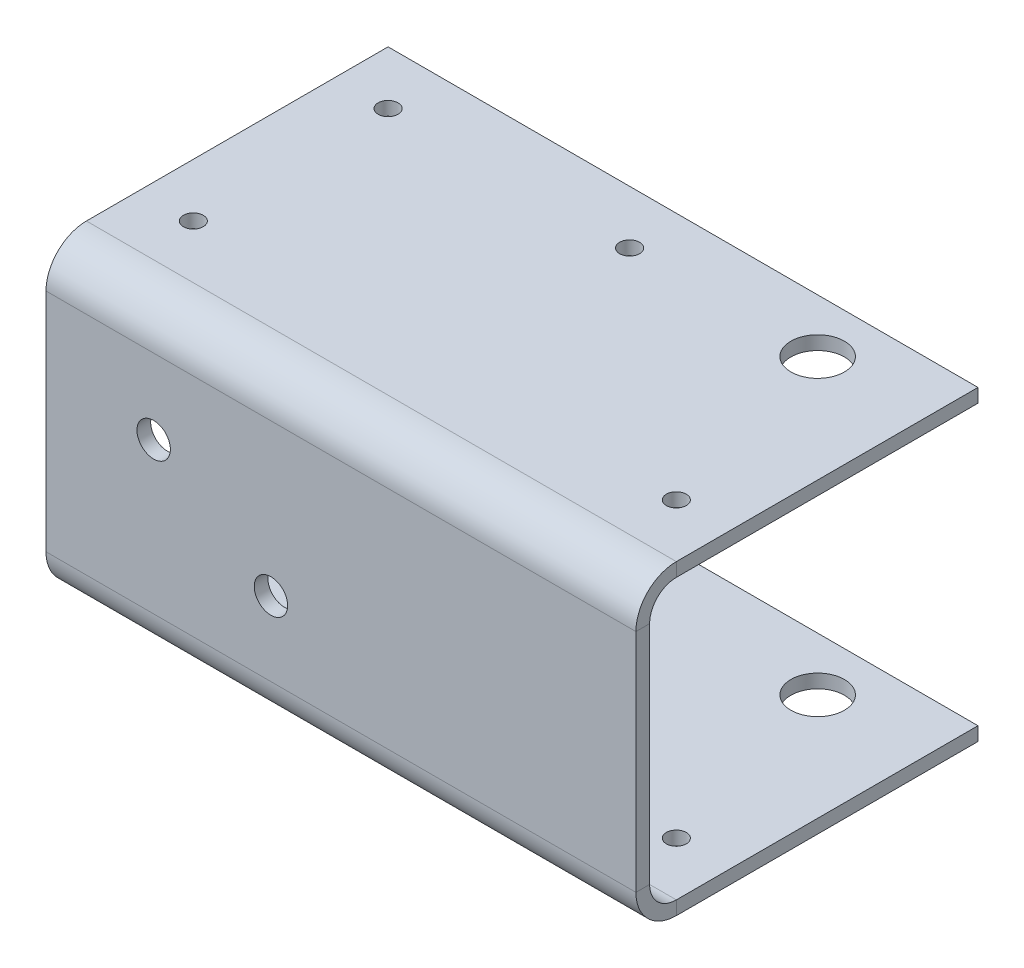
ISO-10303-21;
HEADER;
FILE_DESCRIPTION(('STEP AP214'),'2;1');
FILE_NAME('part.step','',(''),(''),'','','');
FILE_SCHEMA(('AUTOMOTIVE_DESIGN { 1 0 10303 214 1 1 1 1 }'));
ENDSEC;
DATA;
#1=APPLICATION_CONTEXT('core data for automotive mechanical design processes');
#2=APPLICATION_PROTOCOL_DEFINITION('international standard','automotive_design',2000,#1);
#3=PRODUCT_CONTEXT('',#1,'mechanical');
#4=PRODUCT('Part','Part','',(#3));
#5=PRODUCT_RELATED_PRODUCT_CATEGORY('part','',(#4));
#6=PRODUCT_DEFINITION_FORMATION('','',#4);
#7=PRODUCT_DEFINITION_CONTEXT('part definition',#1,'design');
#8=PRODUCT_DEFINITION('design','',#6,#7);
#9=PRODUCT_DEFINITION_SHAPE('','',#8);
#10=(LENGTH_UNIT() NAMED_UNIT(*) SI_UNIT(.MILLI.,.METRE.));
#11=(NAMED_UNIT(*) PLANE_ANGLE_UNIT() SI_UNIT($,.RADIAN.));
#12=(NAMED_UNIT(*) SI_UNIT($,.STERADIAN.) SOLID_ANGLE_UNIT());
#13=UNCERTAINTY_MEASURE_WITH_UNIT(LENGTH_MEASURE(1.E-05),#10,'distance_accuracy_value','');
#14=(GEOMETRIC_REPRESENTATION_CONTEXT(3) GLOBAL_UNCERTAINTY_ASSIGNED_CONTEXT((#13)) GLOBAL_UNIT_ASSIGNED_CONTEXT((#10,
#11,#12)) REPRESENTATION_CONTEXT('',''));
#15=CARTESIAN_POINT('',(0.,0.,0.));
#16=DIRECTION('',(0.,0.,1.));
#17=DIRECTION('',(1.,0.,0.));
#18=AXIS2_PLACEMENT_3D('',#15,#16,#17);
#19=CARTESIAN_POINT('',(-23.0449634343967,-12.8171515576315,0.8128));
#20=DIRECTION('',(1.,0.,0.));
#21=DIRECTION('',(0.,1.,0.));
#22=AXIS2_PLACEMENT_3D('',#19,#20,#21);
#23=PLANE('',#22);
#24=DIRECTION('',(0.,0.,1.));
#25=VECTOR('',#24,1.);
#26=CARTESIAN_POINT('',(-23.0449634343967,-11.2296515576315,0.));
#27=LINE('',#26,#25);
#28=CARTESIAN_POINT('',(-23.0449634343967,-11.2296515576315,0.));
#29=VERTEX_POINT('',#28);
#30=CARTESIAN_POINT('',(-23.0449634343967,-11.2296515576315,0.812800000000019));
#31=VERTEX_POINT('',#30);
#32=EDGE_CURVE('E181',#29,#31,#27,.T.);
#33=ORIENTED_EDGE('',*,*,#32,.T.);
#34=DIRECTION('',(0.,-1.,0.));
#35=VECTOR('',#34,1.);
#36=CARTESIAN_POINT('',(-23.0449634343967,-12.8171515576315,0.8128));
#37=LINE('',#36,#35);
#38=CARTESIAN_POINT('',(-23.0449634343967,2.18534844236849,0.8128));
#39=VERTEX_POINT('',#38);
#40=EDGE_CURVE('E44',#39,#31,#37,.T.);
#41=ORIENTED_EDGE('',*,*,#40,.F.);
#42=DIRECTION('',(0.,0.,1.));
#43=VECTOR('',#42,1.);
#44=CARTESIAN_POINT('',(-23.0449634343967,2.18534844236849,0.));
#45=LINE('',#44,#43);
#46=CARTESIAN_POINT('',(-23.0449634343967,2.18534844236849,0.));
#47=VERTEX_POINT('',#46);
#48=EDGE_CURVE('E240',#47,#39,#45,.T.);
#49=ORIENTED_EDGE('',*,*,#48,.F.);
#50=DIRECTION('',(0.,-1.,0.));
#51=VECTOR('',#50,1.);
#52=CARTESIAN_POINT('',(-23.0449634343967,-12.8171515576315,0.));
#53=LINE('',#52,#51);
#54=EDGE_CURVE('E243',#47,#29,#53,.T.);
#55=ORIENTED_EDGE('',*,*,#54,.T.);
#56=EDGE_LOOP('',(#33,#41,#49,#55));
#57=FACE_BOUND('',#56,.T.);
#58=ADVANCED_FACE('F36',(#57),#23,.F.);
#59=CARTESIAN_POINT('',(11.9971823881,3.77284844236843,0.8128));
#60=DIRECTION('',(-1.,0.,0.));
#61=DIRECTION('',(0.,0.,1.));
#62=AXIS2_PLACEMENT_3D('',#59,#60,#61);
#63=PLANE('',#62);
#64=DIRECTION('',(0.,0.,1.));
#65=VECTOR('',#64,1.);
#66=CARTESIAN_POINT('',(11.9971823881,-11.2296515576315,0.));
#67=LINE('',#66,#65);
#68=CARTESIAN_POINT('',(11.9971823881,-11.2296515576315,0.));
#69=VERTEX_POINT('',#68);
#70=CARTESIAN_POINT('',(11.9971823881,-11.2296515576315,0.8128));
#71=VERTEX_POINT('',#70);
#72=EDGE_CURVE('E187',#69,#71,#67,.T.);
#73=ORIENTED_EDGE('',*,*,#72,.F.);
#74=DIRECTION('',(0.,1.,0.));
#75=VECTOR('',#74,1.);
#76=CARTESIAN_POINT('',(11.9971823881,3.77284844236843,0.));
#77=LINE('',#76,#75);
#78=CARTESIAN_POINT('',(11.9971823881,2.18534844236846,0.));
#79=VERTEX_POINT('',#78);
#80=EDGE_CURVE('E59',#69,#79,#77,.T.);
#81=ORIENTED_EDGE('',*,*,#80,.T.);
#82=DIRECTION('',(0.,0.,1.));
#83=VECTOR('',#82,1.);
#84=CARTESIAN_POINT('',(11.9971823881,2.18534844236843,0.));
#85=LINE('',#84,#83);
#86=CARTESIAN_POINT('',(11.9971823881,2.18534844236843,0.812799999999992));
#87=VERTEX_POINT('',#86);
#88=EDGE_CURVE('E229',#79,#87,#85,.T.);
#89=ORIENTED_EDGE('',*,*,#88,.T.);
#90=DIRECTION('',(0.,1.,0.));
#91=VECTOR('',#90,1.);
#92=CARTESIAN_POINT('',(11.9971823881,3.77284844236843,0.8128));
#93=LINE('',#92,#91);
#94=EDGE_CURVE('E11',#71,#87,#93,.T.);
#95=ORIENTED_EDGE('',*,*,#94,.F.);
#96=EDGE_LOOP('',(#73,#81,#89,#95));
#97=FACE_BOUND('',#96,.T.);
#98=ADVANCED_FACE('F333',(#97),#63,.F.);
#99=CARTESIAN_POINT('',(0.,0.,0.8128));
#100=DIRECTION('',(0.,0.,-1.));
#101=DIRECTION('',(-1.,0.,0.));
#102=AXIS2_PLACEMENT_3D('',#99,#100,#101);
#103=PLANE('',#102);
#104=CARTESIAN_POINT('',(-16.6488971624936,-2.26965155763172,0.8128));
#105=DIRECTION('',(0.,0.,1.));
#106=DIRECTION('',(1.,0.,0.));
#107=AXIS2_PLACEMENT_3D('',#104,#105,#106);
#108=CIRCLE('',#107,0.992251);
#109=CARTESIAN_POINT('',(-15.6566461624936,-2.26965155763172,0.8128));
#110=VERTEX_POINT('',#109);
#111=EDGE_CURVE('E490',#110,#110,#108,.T.);
#112=ORIENTED_EDGE('',*,*,#111,.F.);
#113=EDGE_LOOP('',(#112));
#114=FACE_BOUND('',#113,.T.);
#115=CARTESIAN_POINT('',(-9.68389716249362,-6.82465155763173,0.8128));
#116=DIRECTION('',(0.,0.,1.));
#117=DIRECTION('',(1.,0.,0.));
#118=AXIS2_PLACEMENT_3D('',#115,#116,#117);
#119=CIRCLE('',#118,0.992251);
#120=CARTESIAN_POINT('',(-8.69164616249362,-6.82465155763173,0.8128));
#121=VERTEX_POINT('',#120);
#122=EDGE_CURVE('E406',#121,#121,#119,.T.);
#123=ORIENTED_EDGE('',*,*,#122,.F.);
#124=EDGE_LOOP('',(#123));
#125=FACE_BOUND('',#124,.T.);
#126=DIRECTION('',(-1.,0.,0.));
#127=VECTOR('',#126,1.);
#128=CARTESIAN_POINT('',(-23.0449634343967,-11.2296515576315,0.812800000000019));
#129=LINE('',#128,#127);
#130=EDGE_CURVE('E134',#31,#71,#129,.F.);
#131=ORIENTED_EDGE('',*,*,#130,.T.);
#132=ORIENTED_EDGE('',*,*,#94,.T.);
#133=DIRECTION('',(1.,0.,0.));
#134=VECTOR('',#133,1.);
#135=CARTESIAN_POINT('',(11.9971823881,2.18534844236843,0.812799999999992));
#136=LINE('',#135,#134);
#137=EDGE_CURVE('E223',#87,#39,#136,.F.);
#138=ORIENTED_EDGE('',*,*,#137,.T.);
#139=ORIENTED_EDGE('',*,*,#40,.T.);
#140=EDGE_LOOP('',(#131,#132,#138,#139));
#141=FACE_BOUND('',#140,.T.);
#142=ADVANCED_FACE('F338',(#114,#125,#141),#103,.F.);
#143=CARTESIAN_POINT('',(0.,0.,0.));
#144=DIRECTION('',(0.,0.,-1.));
#145=DIRECTION('',(-1.,0.,0.));
#146=AXIS2_PLACEMENT_3D('',#143,#144,#145);
#147=PLANE('',#146);
#148=CARTESIAN_POINT('',(-16.6488971624936,-2.26965155763172,0.));
#149=DIRECTION('',(0.,0.,-1.));
#150=DIRECTION('',(-1.,0.,0.));
#151=AXIS2_PLACEMENT_3D('',#148,#149,#150);
#152=CIRCLE('',#151,0.992250999999998);
#153=CARTESIAN_POINT('',(-17.6411481624936,-2.26965155763172,0.));
#154=VERTEX_POINT('',#153);
#155=EDGE_CURVE('E400',#154,#154,#152,.T.);
#156=ORIENTED_EDGE('',*,*,#155,.F.);
#157=EDGE_LOOP('',(#156));
#158=FACE_BOUND('',#157,.T.);
#159=CARTESIAN_POINT('',(-9.68389716249362,-6.82465155763173,0.));
#160=DIRECTION('',(0.,0.,-1.));
#161=DIRECTION('',(-1.,0.,0.));
#162=AXIS2_PLACEMENT_3D('',#159,#160,#161);
#163=CIRCLE('',#162,0.992250999999998);
#164=CARTESIAN_POINT('',(-10.6761481624936,-6.82465155763173,0.));
#165=VERTEX_POINT('',#164);
#166=EDGE_CURVE('E403',#165,#165,#163,.T.);
#167=ORIENTED_EDGE('',*,*,#166,.F.);
#168=EDGE_LOOP('',(#167));
#169=FACE_BOUND('',#168,.T.);
#170=ORIENTED_EDGE('',*,*,#80,.F.);
#171=DIRECTION('',(-1.,0.,0.));
#172=VECTOR('',#171,1.);
#173=CARTESIAN_POINT('',(-23.0449634343967,-11.2296515576315,0.));
#174=LINE('',#173,#172);
#175=EDGE_CURVE('E52',#29,#69,#174,.F.);
#176=ORIENTED_EDGE('',*,*,#175,.F.);
#177=ORIENTED_EDGE('',*,*,#54,.F.);
#178=DIRECTION('',(1.,0.,0.));
#179=VECTOR('',#178,1.);
#180=CARTESIAN_POINT('',(11.9971823881,2.18534844236843,0.));
#181=LINE('',#180,#179);
#182=EDGE_CURVE('E235',#79,#47,#181,.F.);
#183=ORIENTED_EDGE('',*,*,#182,.F.);
#184=EDGE_LOOP('',(#170,#176,#177,#183));
#185=FACE_BOUND('',#184,.T.);
#186=ADVANCED_FACE('F340',(#158,#169,#185),#147,.T.);
#187=CARTESIAN_POINT('',(-23.0449634343967,2.18534844236849,-1.5875));
#188=DIRECTION('',(-1.,0.,0.));
#189=DIRECTION('',(0.,-1.,0.));
#190=AXIS2_PLACEMENT_3D('',#187,#188,#189);
#191=PLANE('',#190);
#192=DIRECTION('',(0.,1.,0.));
#193=VECTOR('',#192,1.);
#194=CARTESIAN_POINT('',(-23.0449634343967,3.77284844236848,-1.58749999999999));
#195=LINE('',#194,#193);
#196=CARTESIAN_POINT('',(-23.0449634343967,3.77284844236848,-1.58749999999999));
#197=VERTEX_POINT('',#196);
#198=CARTESIAN_POINT('',(-23.0449634343967,4.58564844236848,-1.58749999999999));
#199=VERTEX_POINT('',#198);
#200=EDGE_CURVE('E190',#197,#199,#195,.T.);
#201=ORIENTED_EDGE('',*,*,#200,.F.);
#202=CARTESIAN_POINT('',(-23.0449634343967,2.18534844236849,-1.5875));
#203=DIRECTION('',(1.,0.,0.));
#204=DIRECTION('',(0.,1.,0.));
#205=AXIS2_PLACEMENT_3D('',#202,#203,#204);
#206=CIRCLE('',#205,1.58749999999999);
#207=EDGE_CURVE('E232',#47,#197,#206,.F.);
#208=ORIENTED_EDGE('',*,*,#207,.F.);
#209=ORIENTED_EDGE('',*,*,#48,.T.);
#210=CARTESIAN_POINT('',(-23.0449634343967,2.18534844236849,-1.5875));
#211=DIRECTION('',(1.,0.,0.));
#212=DIRECTION('',(0.,1.,0.));
#213=AXIS2_PLACEMENT_3D('',#210,#211,#212);
#214=CIRCLE('',#213,2.40029999999999);
#215=EDGE_CURVE('E225',#39,#199,#214,.F.);
#216=ORIENTED_EDGE('',*,*,#215,.T.);
#217=EDGE_LOOP('',(#201,#208,#209,#216));
#218=FACE_BOUND('',#217,.T.);
#219=ADVANCED_FACE('F348',(#218),#191,.T.);
#220=CARTESIAN_POINT('',(11.9971823881,2.18534844236843,-1.5875));
#221=DIRECTION('',(-1.,0.,0.));
#222=DIRECTION('',(0.,-1.,0.));
#223=AXIS2_PLACEMENT_3D('',#220,#221,#222);
#224=PLANE('',#223);
#225=CARTESIAN_POINT('',(11.9971823881,2.18534844236843,-1.5875));
#226=DIRECTION('',(1.,0.,0.));
#227=DIRECTION('',(0.,1.,0.));
#228=AXIS2_PLACEMENT_3D('',#225,#226,#227);
#229=CIRCLE('',#228,1.58749999999999);
#230=CARTESIAN_POINT('',(11.9971823881,3.77284844236843,-1.5875));
#231=VERTEX_POINT('',#230);
#232=EDGE_CURVE('E222',#231,#79,#229,.T.);
#233=ORIENTED_EDGE('',*,*,#232,.F.);
#234=DIRECTION('',(0.,1.,0.));
#235=VECTOR('',#234,1.);
#236=CARTESIAN_POINT('',(11.9971823881,3.77284844236844,-1.5875));
#237=LINE('',#236,#235);
#238=CARTESIAN_POINT('',(11.9971823881,4.58564844236846,-1.58749999999999));
#239=VERTEX_POINT('',#238);
#240=EDGE_CURVE('E195',#231,#239,#237,.T.);
#241=ORIENTED_EDGE('',*,*,#240,.T.);
#242=CARTESIAN_POINT('',(11.9971823881,2.18534844236843,-1.5875));
#243=DIRECTION('',(1.,0.,0.));
#244=DIRECTION('',(0.,1.,0.));
#245=AXIS2_PLACEMENT_3D('',#242,#243,#244);
#246=CIRCLE('',#245,2.40029999999999);
#247=EDGE_CURVE('E226',#239,#87,#246,.T.);
#248=ORIENTED_EDGE('',*,*,#247,.T.);
#249=ORIENTED_EDGE('',*,*,#88,.F.);
#250=EDGE_LOOP('',(#233,#241,#248,#249));
#251=FACE_BOUND('',#250,.T.);
#252=ADVANCED_FACE('F369',(#251),#224,.F.);
#253=CARTESIAN_POINT('',(11.9971823881,2.18534844236843,-1.5875));
#254=DIRECTION('',(1.,0.,0.));
#255=DIRECTION('',(0.,1.,0.));
#256=AXIS2_PLACEMENT_3D('',#253,#254,#255);
#257=CYLINDRICAL_SURFACE('',#256,2.40029999999999);
#258=ORIENTED_EDGE('',*,*,#137,.F.);
#259=ORIENTED_EDGE('',*,*,#247,.F.);
#260=DIRECTION('',(-1.,0.,0.));
#261=VECTOR('',#260,1.);
#262=CARTESIAN_POINT('',(0.,4.58564844236845,-1.58749999999999));
#263=LINE('',#262,#261);
#264=EDGE_CURVE('E198',#239,#199,#263,.T.);
#265=ORIENTED_EDGE('',*,*,#264,.T.);
#266=ORIENTED_EDGE('',*,*,#215,.F.);
#267=EDGE_LOOP('',(#258,#259,#265,#266));
#268=FACE_BOUND('',#267,.T.);
#269=ADVANCED_FACE('F379',(#268),#257,.T.);
#270=CARTESIAN_POINT('',(11.9971823881,2.18534844236843,-1.5875));
#271=DIRECTION('',(1.,0.,0.));
#272=DIRECTION('',(0.,1.,0.));
#273=AXIS2_PLACEMENT_3D('',#270,#271,#272);
#274=CYLINDRICAL_SURFACE('',#273,1.58749999999999);
#275=ORIENTED_EDGE('',*,*,#182,.T.);
#276=ORIENTED_EDGE('',*,*,#207,.T.);
#277=DIRECTION('',(1.,0.,0.));
#278=VECTOR('',#277,1.);
#279=CARTESIAN_POINT('',(-23.0449634343967,3.77284844236848,-1.58749999999999));
#280=LINE('',#279,#278);
#281=EDGE_CURVE('E193',#197,#231,#280,.T.);
#282=ORIENTED_EDGE('',*,*,#281,.T.);
#283=ORIENTED_EDGE('',*,*,#232,.T.);
#284=EDGE_LOOP('',(#275,#276,#282,#283));
#285=FACE_BOUND('',#284,.T.);
#286=ADVANCED_FACE('F344',(#285),#274,.F.);
#287=CARTESIAN_POINT('',(11.9971823880999,4.5856484423685,-19.5072));
#288=DIRECTION('',(-1.,0.,0.));
#289=DIRECTION('',(0.,-1.,0.));
#290=AXIS2_PLACEMENT_3D('',#287,#288,#289);
#291=PLANE('',#290);
#292=ORIENTED_EDGE('',*,*,#240,.F.);
#293=DIRECTION('',(0.,0.,-1.));
#294=VECTOR('',#293,1.);
#295=CARTESIAN_POINT('',(11.9971823880999,3.7728484423685,-19.5072));
#296=LINE('',#295,#294);
#297=CARTESIAN_POINT('',(11.9971823880999,3.7728484423685,-19.5072));
#298=VERTEX_POINT('',#297);
#299=EDGE_CURVE('E202',#231,#298,#296,.T.);
#300=ORIENTED_EDGE('',*,*,#299,.T.);
#301=DIRECTION('',(0.,-1.,0.));
#302=VECTOR('',#301,1.);
#303=CARTESIAN_POINT('',(11.9971823880999,4.5856484423685,-19.5072));
#304=LINE('',#303,#302);
#305=CARTESIAN_POINT('',(11.9971823880999,4.5856484423685,-19.5072));
#306=VERTEX_POINT('',#305);
#307=EDGE_CURVE('E219',#306,#298,#304,.T.);
#308=ORIENTED_EDGE('',*,*,#307,.F.);
#309=DIRECTION('',(0.,0.,-1.));
#310=VECTOR('',#309,1.);
#311=CARTESIAN_POINT('',(11.9971823880999,4.5856484423685,-19.5072));
#312=LINE('',#311,#310);
#313=EDGE_CURVE('E203',#239,#306,#312,.T.);
#314=ORIENTED_EDGE('',*,*,#313,.F.);
#315=EDGE_LOOP('',(#292,#300,#308,#314));
#316=FACE_BOUND('',#315,.T.);
#317=ADVANCED_FACE('F371',(#316),#291,.F.);
#318=CARTESIAN_POINT('',(-23.0449634343967,4.58564844236848,0.));
#319=DIRECTION('',(1.,0.,0.));
#320=DIRECTION('',(0.,1.,0.));
#321=AXIS2_PLACEMENT_3D('',#318,#319,#320);
#322=PLANE('',#321);
#323=ORIENTED_EDGE('',*,*,#200,.T.);
#324=DIRECTION('',(0.,0.,1.));
#325=VECTOR('',#324,1.);
#326=CARTESIAN_POINT('',(-23.0449634343967,4.58564844236848,0.));
#327=LINE('',#326,#325);
#328=CARTESIAN_POINT('',(-23.0449634343967,4.58564844236855,-19.5072));
#329=VERTEX_POINT('',#328);
#330=EDGE_CURVE('E208',#329,#199,#327,.T.);
#331=ORIENTED_EDGE('',*,*,#330,.F.);
#332=DIRECTION('',(0.,-1.,0.));
#333=VECTOR('',#332,1.);
#334=CARTESIAN_POINT('',(-23.0449634343967,4.58564844236855,-19.5072));
#335=LINE('',#334,#333);
#336=CARTESIAN_POINT('',(-23.0449634343967,3.77284844236855,-19.5072));
#337=VERTEX_POINT('',#336);
#338=EDGE_CURVE('E211',#329,#337,#335,.T.);
#339=ORIENTED_EDGE('',*,*,#338,.T.);
#340=DIRECTION('',(0.,0.,1.));
#341=VECTOR('',#340,1.);
#342=CARTESIAN_POINT('',(-23.0449634343967,3.77284844236848,0.));
#343=LINE('',#342,#341);
#344=EDGE_CURVE('E206',#337,#197,#343,.T.);
#345=ORIENTED_EDGE('',*,*,#344,.T.);
#346=EDGE_LOOP('',(#323,#331,#339,#345));
#347=FACE_BOUND('',#346,.T.);
#348=ADVANCED_FACE('F352',(#347),#322,.F.);
#349=CARTESIAN_POINT('',(0.,4.58564844236845,0.));
#350=DIRECTION('',(0.,-1.,0.));
#351=DIRECTION('',(0.,0.,-1.));
#352=AXIS2_PLACEMENT_3D('',#349,#350,#351);
#353=PLANE('',#352);
#354=CARTESIAN_POINT('',(-5.52389052314841,4.58564844236854,-16.3322));
#355=DIRECTION('',(0.,-1.,0.));
#356=DIRECTION('',(0.,0.,-1.));
#357=AXIS2_PLACEMENT_3D('',#354,#355,#356);
#358=CIRCLE('',#357,0.590549999999997);
#359=CARTESIAN_POINT('',(-5.52389052314841,4.58564844236854,-16.92275));
#360=VERTEX_POINT('',#359);
#361=EDGE_CURVE('E409',#360,#360,#358,.T.);
#362=ORIENTED_EDGE('',*,*,#361,.T.);
#363=EDGE_LOOP('',(#362));
#364=FACE_BOUND('',#363,.T.);
#365=CARTESIAN_POINT('',(-19.8699634343967,4.58564844236854,-16.3322));
#366=DIRECTION('',(0.,-1.,0.));
#367=DIRECTION('',(0.,0.,-1.));
#368=AXIS2_PLACEMENT_3D('',#365,#366,#367);
#369=CIRCLE('',#368,0.590549999999999);
#370=CARTESIAN_POINT('',(-19.8699634343967,4.58564844236854,-16.92275));
#371=VERTEX_POINT('',#370);
#372=EDGE_CURVE('E265',#371,#371,#369,.T.);
#373=ORIENTED_EDGE('',*,*,#372,.T.);
#374=EDGE_LOOP('',(#373));
#375=FACE_BOUND('',#374,.T.);
#376=CARTESIAN_POINT('',(-19.8699634343967,4.58564844236858,-4.76250000000013));
#377=DIRECTION('',(0.,-1.,0.));
#378=DIRECTION('',(0.,0.,-1.));
#379=AXIS2_PLACEMENT_3D('',#376,#377,#378);
#380=CIRCLE('',#379,0.590549999999999);
#381=CARTESIAN_POINT('',(-19.8699634343967,4.58564844236858,-5.35305000000013));
#382=VERTEX_POINT('',#381);
#383=EDGE_CURVE('E261',#382,#382,#380,.T.);
#384=ORIENTED_EDGE('',*,*,#383,.T.);
#385=EDGE_LOOP('',(#384));
#386=FACE_BOUND('',#385,.T.);
#387=CARTESIAN_POINT('',(8.82218238809985,4.58564844236858,-4.7625000000001));
#388=DIRECTION('',(0.,-1.,0.));
#389=DIRECTION('',(0.,0.,-1.));
#390=AXIS2_PLACEMENT_3D('',#387,#388,#389);
#391=CIRCLE('',#390,0.590549999999997);
#392=CARTESIAN_POINT('',(8.82218238809985,4.58564844236858,-5.3530500000001));
#393=VERTEX_POINT('',#392);
#394=EDGE_CURVE('E257',#393,#393,#391,.T.);
#395=ORIENTED_EDGE('',*,*,#394,.T.);
#396=EDGE_LOOP('',(#395));
#397=FACE_BOUND('',#396,.T.);
#398=CARTESIAN_POINT('',(5.64718238809993,4.58564844236853,-16.3322));
#399=DIRECTION('',(0.,-1.,0.));
#400=DIRECTION('',(0.,0.,-1.));
#401=AXIS2_PLACEMENT_3D('',#398,#399,#400);
#402=CIRCLE('',#401,1.5875);
#403=CARTESIAN_POINT('',(5.64718238809993,4.58564844236853,-17.9197));
#404=VERTEX_POINT('',#403);
#405=EDGE_CURVE('E252',#404,#404,#402,.T.);
#406=ORIENTED_EDGE('',*,*,#405,.T.);
#407=EDGE_LOOP('',(#406));
#408=FACE_BOUND('',#407,.T.);
#409=ORIENTED_EDGE('',*,*,#264,.F.);
#410=ORIENTED_EDGE('',*,*,#313,.T.);
#411=DIRECTION('',(-1.,0.,0.));
#412=VECTOR('',#411,1.);
#413=CARTESIAN_POINT('',(-23.0449634343967,4.58564844236855,-19.5072));
#414=LINE('',#413,#412);
#415=EDGE_CURVE('E205',#306,#329,#414,.T.);
#416=ORIENTED_EDGE('',*,*,#415,.T.);
#417=ORIENTED_EDGE('',*,*,#330,.T.);
#418=EDGE_LOOP('',(#409,#410,#416,#417));
#419=FACE_BOUND('',#418,.T.);
#420=ADVANCED_FACE('F356',(#364,#375,#386,#397,#408,#419),#353,.F.);
#421=CARTESIAN_POINT('',(0.,3.77284844236845,0.));
#422=DIRECTION('',(0.,-1.,0.));
#423=DIRECTION('',(0.,0.,-1.));
#424=AXIS2_PLACEMENT_3D('',#421,#422,#423);
#425=PLANE('',#424);
#426=CARTESIAN_POINT('',(-5.52389052314841,3.77284844236851,-16.3322));
#427=DIRECTION('',(0.,-1.,0.));
#428=DIRECTION('',(0.,0.,-1.));
#429=AXIS2_PLACEMENT_3D('',#426,#427,#428);
#430=CIRCLE('',#429,0.590549999999998);
#431=CARTESIAN_POINT('',(-5.52389052314841,3.77284844236851,-16.92275));
#432=VERTEX_POINT('',#431);
#433=EDGE_CURVE('E39',#432,#432,#430,.T.);
#434=ORIENTED_EDGE('',*,*,#433,.F.);
#435=EDGE_LOOP('',(#434));
#436=FACE_BOUND('',#435,.T.);
#437=CARTESIAN_POINT('',(-19.8699634343967,3.77284844236853,-16.3322));
#438=DIRECTION('',(0.,-1.,0.));
#439=DIRECTION('',(0.,0.,-1.));
#440=AXIS2_PLACEMENT_3D('',#437,#438,#439);
#441=CIRCLE('',#440,0.590549999999999);
#442=CARTESIAN_POINT('',(-19.8699634343967,3.77284844236853,-16.92275));
#443=VERTEX_POINT('',#442);
#444=EDGE_CURVE('E262',#443,#443,#441,.T.);
#445=ORIENTED_EDGE('',*,*,#444,.F.);
#446=EDGE_LOOP('',(#445));
#447=FACE_BOUND('',#446,.T.);
#448=CARTESIAN_POINT('',(-19.8699634343967,3.77284844236849,-4.76250000000013));
#449=DIRECTION('',(0.,-1.,0.));
#450=DIRECTION('',(0.,0.,-1.));
#451=AXIS2_PLACEMENT_3D('',#448,#449,#450);
#452=CIRCLE('',#451,0.590549999999999);
#453=CARTESIAN_POINT('',(-19.8699634343967,3.77284844236849,-5.35305000000013));
#454=VERTEX_POINT('',#453);
#455=EDGE_CURVE('E258',#454,#454,#452,.T.);
#456=ORIENTED_EDGE('',*,*,#455,.F.);
#457=EDGE_LOOP('',(#456));
#458=FACE_BOUND('',#457,.T.);
#459=CARTESIAN_POINT('',(8.82218238809985,3.77284844236846,-4.7625000000001));
#460=DIRECTION('',(0.,-1.,0.));
#461=DIRECTION('',(0.,0.,-1.));
#462=AXIS2_PLACEMENT_3D('',#459,#460,#461);
#463=CIRCLE('',#462,0.590549999999998);
#464=CARTESIAN_POINT('',(8.82218238809985,3.77284844236846,-5.3530500000001));
#465=VERTEX_POINT('',#464);
#466=EDGE_CURVE('E256',#465,#465,#463,.T.);
#467=ORIENTED_EDGE('',*,*,#466,.F.);
#468=EDGE_LOOP('',(#467));
#469=FACE_BOUND('',#468,.T.);
#470=CARTESIAN_POINT('',(5.64718238809993,3.7728484423685,-16.3322));
#471=DIRECTION('',(0.,-1.,0.));
#472=DIRECTION('',(0.,0.,-1.));
#473=AXIS2_PLACEMENT_3D('',#470,#471,#472);
#474=CIRCLE('',#473,1.58749999999999);
#475=CARTESIAN_POINT('',(5.64718238809993,3.7728484423685,-17.9197));
#476=VERTEX_POINT('',#475);
#477=EDGE_CURVE('E251',#476,#476,#474,.T.);
#478=ORIENTED_EDGE('',*,*,#477,.F.);
#479=EDGE_LOOP('',(#478));
#480=FACE_BOUND('',#479,.T.);
#481=ORIENTED_EDGE('',*,*,#299,.F.);
#482=ORIENTED_EDGE('',*,*,#281,.F.);
#483=ORIENTED_EDGE('',*,*,#344,.F.);
#484=DIRECTION('',(-1.,0.,0.));
#485=VECTOR('',#484,1.);
#486=CARTESIAN_POINT('',(-23.0449634343967,3.77284844236855,-19.5072));
#487=LINE('',#486,#485);
#488=EDGE_CURVE('E213',#298,#337,#487,.T.);
#489=ORIENTED_EDGE('',*,*,#488,.F.);
#490=EDGE_LOOP('',(#481,#482,#483,#489));
#491=FACE_BOUND('',#490,.T.);
#492=ADVANCED_FACE('F366',(#436,#447,#458,#469,#480,#491),#425,.T.);
#493=CARTESIAN_POINT('',(-23.0449634343967,4.58564844236855,-19.5072));
#494=DIRECTION('',(0.,0.,1.));
#495=DIRECTION('',(0.,-1.,0.));
#496=AXIS2_PLACEMENT_3D('',#493,#494,#495);
#497=PLANE('',#496);
#498=ORIENTED_EDGE('',*,*,#488,.T.);
#499=ORIENTED_EDGE('',*,*,#338,.F.);
#500=ORIENTED_EDGE('',*,*,#415,.F.);
#501=ORIENTED_EDGE('',*,*,#307,.T.);
#502=EDGE_LOOP('',(#498,#499,#500,#501));
#503=FACE_BOUND('',#502,.T.);
#504=ADVANCED_FACE('F362',(#503),#497,.F.);
#505=CARTESIAN_POINT('',(11.9971823881,-11.2296515576315,-1.5875));
#506=DIRECTION('',(1.,0.,0.));
#507=DIRECTION('',(0.,0.,-1.));
#508=AXIS2_PLACEMENT_3D('',#505,#506,#507);
#509=PLANE('',#508);
#510=DIRECTION('',(0.,-1.,0.));
#511=VECTOR('',#510,1.);
#512=CARTESIAN_POINT('',(11.9971823880999,-12.8171515576316,-1.5875));
#513=LINE('',#512,#511);
#514=CARTESIAN_POINT('',(11.9971823881,-12.8171515576316,-1.58749999999999));
#515=VERTEX_POINT('',#514);
#516=CARTESIAN_POINT('',(11.9971823881,-13.6299515576316,-1.58749999999999));
#517=VERTEX_POINT('',#516);
#518=EDGE_CURVE('E301',#515,#517,#513,.T.);
#519=ORIENTED_EDGE('',*,*,#518,.F.);
#520=CARTESIAN_POINT('',(11.9971823881,-11.2296515576315,-1.5875));
#521=DIRECTION('',(-1.,0.,0.));
#522=DIRECTION('',(0.,0.,1.));
#523=AXIS2_PLACEMENT_3D('',#520,#521,#522);
#524=CIRCLE('',#523,1.58750000000002);
#525=EDGE_CURVE('E137',#69,#515,#524,.F.);
#526=ORIENTED_EDGE('',*,*,#525,.F.);
#527=ORIENTED_EDGE('',*,*,#72,.T.);
#528=CARTESIAN_POINT('',(11.9971823881,-11.2296515576315,-1.5875));
#529=DIRECTION('',(-1.,0.,0.));
#530=DIRECTION('',(0.,0.,1.));
#531=AXIS2_PLACEMENT_3D('',#528,#529,#530);
#532=CIRCLE('',#531,2.40030000000002);
#533=EDGE_CURVE('E180',#71,#517,#532,.F.);
#534=ORIENTED_EDGE('',*,*,#533,.T.);
#535=EDGE_LOOP('',(#519,#526,#527,#534));
#536=FACE_BOUND('',#535,.T.);
#537=ADVANCED_FACE('F308',(#536),#509,.T.);
#538=CARTESIAN_POINT('',(-23.0449634343967,-11.2296515576315,-1.5875));
#539=DIRECTION('',(1.,0.,0.));
#540=DIRECTION('',(0.,0.,-1.));
#541=AXIS2_PLACEMENT_3D('',#538,#539,#540);
#542=PLANE('',#541);
#543=CARTESIAN_POINT('',(-23.0449634343967,-11.2296515576315,-1.5875));
#544=DIRECTION('',(-1.,0.,0.));
#545=DIRECTION('',(0.,0.,1.));
#546=AXIS2_PLACEMENT_3D('',#543,#544,#545);
#547=CIRCLE('',#546,1.58750000000002);
#548=CARTESIAN_POINT('',(-23.0449634343967,-12.8171515576316,-1.5875));
#549=VERTEX_POINT('',#548);
#550=EDGE_CURVE('E144',#549,#29,#547,.T.);
#551=ORIENTED_EDGE('',*,*,#550,.F.);
#552=DIRECTION('',(0.,-1.,0.));
#553=VECTOR('',#552,1.);
#554=CARTESIAN_POINT('',(-23.0449634343967,-12.8171515576315,-1.5875));
#555=LINE('',#554,#553);
#556=CARTESIAN_POINT('',(-23.0449634343967,-13.6299515576315,-1.58749999999999));
#557=VERTEX_POINT('',#556);
#558=EDGE_CURVE('E141',#549,#557,#555,.T.);
#559=ORIENTED_EDGE('',*,*,#558,.T.);
#560=CARTESIAN_POINT('',(-23.0449634343967,-11.2296515576315,-1.5875));
#561=DIRECTION('',(-1.,0.,0.));
#562=DIRECTION('',(0.,0.,1.));
#563=AXIS2_PLACEMENT_3D('',#560,#561,#562);
#564=CIRCLE('',#563,2.40030000000002);
#565=EDGE_CURVE('E127',#557,#31,#564,.T.);
#566=ORIENTED_EDGE('',*,*,#565,.T.);
#567=ORIENTED_EDGE('',*,*,#32,.F.);
#568=EDGE_LOOP('',(#551,#559,#566,#567));
#569=FACE_BOUND('',#568,.T.);
#570=ADVANCED_FACE('F142',(#569),#542,.F.);
#571=CARTESIAN_POINT('',(-23.0449634343967,-11.2296515576315,-1.5875));
#572=DIRECTION('',(-1.,0.,0.));
#573=DIRECTION('',(0.,-1.,0.));
#574=AXIS2_PLACEMENT_3D('',#571,#572,#573);
#575=CYLINDRICAL_SURFACE('',#574,2.40030000000002);
#576=ORIENTED_EDGE('',*,*,#130,.F.);
#577=ORIENTED_EDGE('',*,*,#565,.F.);
#578=DIRECTION('',(1.,0.,0.));
#579=VECTOR('',#578,1.);
#580=CARTESIAN_POINT('',(0.,-13.6299515576316,-1.58749999999999));
#581=LINE('',#580,#579);
#582=EDGE_CURVE('E132',#557,#517,#581,.T.);
#583=ORIENTED_EDGE('',*,*,#582,.T.);
#584=ORIENTED_EDGE('',*,*,#533,.F.);
#585=EDGE_LOOP('',(#576,#577,#583,#584));
#586=FACE_BOUND('',#585,.T.);
#587=ADVANCED_FACE('F129',(#586),#575,.T.);
#588=CARTESIAN_POINT('',(-23.0449634343967,-11.2296515576315,-1.5875));
#589=DIRECTION('',(-1.,0.,0.));
#590=DIRECTION('',(0.,-1.,0.));
#591=AXIS2_PLACEMENT_3D('',#588,#589,#590);
#592=CYLINDRICAL_SURFACE('',#591,1.58750000000002);
#593=ORIENTED_EDGE('',*,*,#175,.T.);
#594=ORIENTED_EDGE('',*,*,#525,.T.);
#595=DIRECTION('',(-1.,0.,0.));
#596=VECTOR('',#595,1.);
#597=CARTESIAN_POINT('',(11.9971823880999,-12.8171515576316,-1.5875));
#598=LINE('',#597,#596);
#599=EDGE_CURVE('E148',#515,#549,#598,.T.);
#600=ORIENTED_EDGE('',*,*,#599,.T.);
#601=ORIENTED_EDGE('',*,*,#550,.T.);
#602=EDGE_LOOP('',(#593,#594,#600,#601));
#603=FACE_BOUND('',#602,.T.);
#604=ADVANCED_FACE('F311',(#603),#592,.F.);
#605=CARTESIAN_POINT('',(-23.0449634343967,-13.6299515576316,-19.5072));
#606=DIRECTION('',(1.,0.,0.));
#607=DIRECTION('',(0.,1.,0.));
#608=AXIS2_PLACEMENT_3D('',#605,#606,#607);
#609=PLANE('',#608);
#610=ORIENTED_EDGE('',*,*,#558,.F.);
#611=DIRECTION('',(0.,0.,-1.));
#612=VECTOR('',#611,1.);
#613=CARTESIAN_POINT('',(-23.0449634343967,-12.8171515576316,-19.5072));
#614=LINE('',#613,#612);
#615=CARTESIAN_POINT('',(-23.0449634343967,-12.8171515576316,-19.5072));
#616=VERTEX_POINT('',#615);
#617=EDGE_CURVE('E157',#549,#616,#614,.T.);
#618=ORIENTED_EDGE('',*,*,#617,.T.);
#619=DIRECTION('',(0.,1.,0.));
#620=VECTOR('',#619,1.);
#621=CARTESIAN_POINT('',(-23.0449634343967,-13.6299515576316,-19.5072));
#622=LINE('',#621,#620);
#623=CARTESIAN_POINT('',(-23.0449634343967,-13.6299515576316,-19.5072));
#624=VERTEX_POINT('',#623);
#625=EDGE_CURVE('E162',#624,#616,#622,.T.);
#626=ORIENTED_EDGE('',*,*,#625,.F.);
#627=DIRECTION('',(0.,0.,-1.));
#628=VECTOR('',#627,1.);
#629=CARTESIAN_POINT('',(-23.0449634343967,-13.6299515576316,-19.5072));
#630=LINE('',#629,#628);
#631=EDGE_CURVE('E153',#557,#624,#630,.T.);
#632=ORIENTED_EDGE('',*,*,#631,.F.);
#633=EDGE_LOOP('',(#610,#618,#626,#632));
#634=FACE_BOUND('',#633,.T.);
#635=ADVANCED_FACE('F160',(#634),#609,.F.);
#636=CARTESIAN_POINT('',(11.9971823881,-13.6299515576316,0.));
#637=DIRECTION('',(-1.,0.,0.));
#638=DIRECTION('',(0.,0.,1.));
#639=AXIS2_PLACEMENT_3D('',#636,#637,#638);
#640=PLANE('',#639);
#641=ORIENTED_EDGE('',*,*,#518,.T.);
#642=DIRECTION('',(0.,0.,1.));
#643=VECTOR('',#642,1.);
#644=CARTESIAN_POINT('',(11.9971823881,-13.6299515576316,0.));
#645=LINE('',#644,#643);
#646=CARTESIAN_POINT('',(11.9971823880999,-13.6299515576316,-19.5072));
#647=VERTEX_POINT('',#646);
#648=EDGE_CURVE('E156',#647,#517,#645,.T.);
#649=ORIENTED_EDGE('',*,*,#648,.F.);
#650=DIRECTION('',(0.,1.,0.));
#651=VECTOR('',#650,1.);
#652=CARTESIAN_POINT('',(11.9971823880999,-13.6299515576316,-19.5072));
#653=LINE('',#652,#651);
#654=CARTESIAN_POINT('',(11.9971823880999,-12.8171515576316,-19.5072));
#655=VERTEX_POINT('',#654);
#656=EDGE_CURVE('E173',#647,#655,#653,.T.);
#657=ORIENTED_EDGE('',*,*,#656,.T.);
#658=DIRECTION('',(0.,0.,1.));
#659=VECTOR('',#658,1.);
#660=CARTESIAN_POINT('',(11.9971823881,-12.8171515576316,0.));
#661=LINE('',#660,#659);
#662=EDGE_CURVE('E164',#655,#515,#661,.T.);
#663=ORIENTED_EDGE('',*,*,#662,.T.);
#664=EDGE_LOOP('',(#641,#649,#657,#663));
#665=FACE_BOUND('',#664,.T.);
#666=ADVANCED_FACE('F304',(#665),#640,.F.);
#667=CARTESIAN_POINT('',(0.,-13.6299515576315,0.));
#668=DIRECTION('',(0.,1.,0.));
#669=DIRECTION('',(0.,0.,1.));
#670=AXIS2_PLACEMENT_3D('',#667,#668,#669);
#671=PLANE('',#670);
#672=CARTESIAN_POINT('',(-5.52389052314841,-13.6299515576316,-16.3322));
#673=DIRECTION('',(0.,-1.,0.));
#674=DIRECTION('',(0.,0.,-1.));
#675=AXIS2_PLACEMENT_3D('',#672,#673,#674);
#676=CIRCLE('',#675,0.59055);
#677=CARTESIAN_POINT('',(-5.52389052314841,-13.6299515576316,-16.92275));
#678=VERTEX_POINT('',#677);
#679=EDGE_CURVE('E405',#678,#678,#676,.T.);
#680=ORIENTED_EDGE('',*,*,#679,.F.);
#681=EDGE_LOOP('',(#680));
#682=FACE_BOUND('',#681,.T.);
#683=CARTESIAN_POINT('',(-19.8699634343967,-13.6299515576316,-16.3322));
#684=DIRECTION('',(0.,-1.,0.));
#685=DIRECTION('',(0.,0.,-1.));
#686=AXIS2_PLACEMENT_3D('',#683,#684,#685);
#687=CIRCLE('',#686,0.590549999999999);
#688=CARTESIAN_POINT('',(-19.8699634343967,-13.6299515576316,-16.92275));
#689=VERTEX_POINT('',#688);
#690=EDGE_CURVE('E272',#689,#689,#687,.T.);
#691=ORIENTED_EDGE('',*,*,#690,.F.);
#692=EDGE_LOOP('',(#691));
#693=FACE_BOUND('',#692,.T.);
#694=CARTESIAN_POINT('',(-19.8699634343967,-13.6299515576316,-4.76250000000013));
#695=DIRECTION('',(0.,-1.,0.));
#696=DIRECTION('',(0.,0.,-1.));
#697=AXIS2_PLACEMENT_3D('',#694,#695,#696);
#698=CIRCLE('',#697,0.590549999999999);
#699=CARTESIAN_POINT('',(-19.8699634343967,-13.6299515576316,-5.35305000000013));
#700=VERTEX_POINT('',#699);
#701=EDGE_CURVE('E269',#700,#700,#698,.T.);
#702=ORIENTED_EDGE('',*,*,#701,.F.);
#703=EDGE_LOOP('',(#702));
#704=FACE_BOUND('',#703,.T.);
#705=CARTESIAN_POINT('',(8.82218238809985,-13.6299515576316,-4.7625000000001));
#706=DIRECTION('',(0.,-1.,0.));
#707=DIRECTION('',(0.,0.,-1.));
#708=AXIS2_PLACEMENT_3D('',#705,#706,#707);
#709=CIRCLE('',#708,0.590549999999999);
#710=CARTESIAN_POINT('',(8.82218238809985,-13.6299515576316,-5.3530500000001));
#711=VERTEX_POINT('',#710);
#712=EDGE_CURVE('E287',#711,#711,#709,.T.);
#713=ORIENTED_EDGE('',*,*,#712,.F.);
#714=EDGE_LOOP('',(#713));
#715=FACE_BOUND('',#714,.T.);
#716=CARTESIAN_POINT('',(5.64718238809993,-13.6299515576316,-16.3322));
#717=DIRECTION('',(0.,-1.,0.));
#718=DIRECTION('',(0.,0.,-1.));
#719=AXIS2_PLACEMENT_3D('',#716,#717,#718);
#720=CIRCLE('',#719,1.58749999999999);
#721=CARTESIAN_POINT('',(5.64718238809993,-13.6299515576316,-17.9197));
#722=VERTEX_POINT('',#721);
#723=EDGE_CURVE('E294',#722,#722,#720,.T.);
#724=ORIENTED_EDGE('',*,*,#723,.F.);
#725=EDGE_LOOP('',(#724));
#726=FACE_BOUND('',#725,.T.);
#727=ORIENTED_EDGE('',*,*,#582,.F.);
#728=ORIENTED_EDGE('',*,*,#631,.T.);
#729=DIRECTION('',(1.,0.,0.));
#730=VECTOR('',#729,1.);
#731=CARTESIAN_POINT('',(11.9971823880999,-13.6299515576316,-19.5072));
#732=LINE('',#731,#730);
#733=EDGE_CURVE('E163',#624,#647,#732,.T.);
#734=ORIENTED_EDGE('',*,*,#733,.T.);
#735=ORIENTED_EDGE('',*,*,#648,.T.);
#736=EDGE_LOOP('',(#727,#728,#734,#735));
#737=FACE_BOUND('',#736,.T.);
#738=ADVANCED_FACE('F152',(#682,#693,#704,#715,#726,#737),#671,.F.);
#739=CARTESIAN_POINT('',(0.,-12.8171515576315,0.));
#740=DIRECTION('',(0.,1.,0.));
#741=DIRECTION('',(0.,0.,1.));
#742=AXIS2_PLACEMENT_3D('',#739,#740,#741);
#743=PLANE('',#742);
#744=CARTESIAN_POINT('',(-5.52389052314841,-12.8171515576316,-16.3322));
#745=DIRECTION('',(0.,1.,0.));
#746=DIRECTION('',(0.,0.,1.));
#747=AXIS2_PLACEMENT_3D('',#744,#745,#746);
#748=CIRCLE('',#747,0.590549999999998);
#749=CARTESIAN_POINT('',(-5.52389052314841,-12.8171515576316,-15.74165));
#750=VERTEX_POINT('',#749);
#751=EDGE_CURVE('E277',#750,#750,#748,.T.);
#752=ORIENTED_EDGE('',*,*,#751,.F.);
#753=EDGE_LOOP('',(#752));
#754=FACE_BOUND('',#753,.T.);
#755=CARTESIAN_POINT('',(-19.8699634343967,-12.8171515576316,-16.3322));
#756=DIRECTION('',(0.,1.,0.));
#757=DIRECTION('',(0.,0.,1.));
#758=AXIS2_PLACEMENT_3D('',#755,#756,#757);
#759=CIRCLE('',#758,0.590549999999999);
#760=CARTESIAN_POINT('',(-19.8699634343967,-12.8171515576316,-15.74165));
#761=VERTEX_POINT('',#760);
#762=EDGE_CURVE('E264',#761,#761,#759,.T.);
#763=ORIENTED_EDGE('',*,*,#762,.F.);
#764=EDGE_LOOP('',(#763));
#765=FACE_BOUND('',#764,.T.);
#766=CARTESIAN_POINT('',(-19.8699634343967,-12.8171515576315,-4.76250000000013));
#767=DIRECTION('',(0.,1.,0.));
#768=DIRECTION('',(0.,0.,1.));
#769=AXIS2_PLACEMENT_3D('',#766,#767,#768);
#770=CIRCLE('',#769,0.590549999999999);
#771=CARTESIAN_POINT('',(-19.8699634343967,-12.8171515576315,-4.17195000000013));
#772=VERTEX_POINT('',#771);
#773=EDGE_CURVE('E260',#772,#772,#770,.T.);
#774=ORIENTED_EDGE('',*,*,#773,.F.);
#775=EDGE_LOOP('',(#774));
#776=FACE_BOUND('',#775,.T.);
#777=CARTESIAN_POINT('',(8.82218238809985,-12.8171515576316,-4.7625000000001));
#778=DIRECTION('',(0.,1.,0.));
#779=DIRECTION('',(0.,0.,1.));
#780=AXIS2_PLACEMENT_3D('',#777,#778,#779);
#781=CIRCLE('',#780,0.590549999999998);
#782=CARTESIAN_POINT('',(8.82218238809985,-12.8171515576316,-4.1719500000001));
#783=VERTEX_POINT('',#782);
#784=EDGE_CURVE('E253',#783,#783,#781,.T.);
#785=ORIENTED_EDGE('',*,*,#784,.F.);
#786=EDGE_LOOP('',(#785));
#787=FACE_BOUND('',#786,.T.);
#788=CARTESIAN_POINT('',(5.64718238809993,-12.8171515576316,-16.3322));
#789=DIRECTION('',(0.,1.,0.));
#790=DIRECTION('',(0.,0.,1.));
#791=AXIS2_PLACEMENT_3D('',#788,#789,#790);
#792=CIRCLE('',#791,1.58749999999999);
#793=CARTESIAN_POINT('',(5.64718238809993,-12.8171515576316,-14.7447));
#794=VERTEX_POINT('',#793);
#795=EDGE_CURVE('E248',#794,#794,#792,.T.);
#796=ORIENTED_EDGE('',*,*,#795,.F.);
#797=EDGE_LOOP('',(#796));
#798=FACE_BOUND('',#797,.T.);
#799=ORIENTED_EDGE('',*,*,#617,.F.);
#800=ORIENTED_EDGE('',*,*,#599,.F.);
#801=ORIENTED_EDGE('',*,*,#662,.F.);
#802=DIRECTION('',(1.,0.,0.));
#803=VECTOR('',#802,1.);
#804=CARTESIAN_POINT('',(11.9971823880999,-12.8171515576316,-19.5072));
#805=LINE('',#804,#803);
#806=EDGE_CURVE('E168',#616,#655,#805,.T.);
#807=ORIENTED_EDGE('',*,*,#806,.F.);
#808=EDGE_LOOP('',(#799,#800,#801,#807));
#809=FACE_BOUND('',#808,.T.);
#810=ADVANCED_FACE('F313',(#754,#765,#776,#787,#798,#809),#743,.T.);
#811=CARTESIAN_POINT('',(11.9971823880999,-13.6299515576316,-19.5072));
#812=DIRECTION('',(0.,0.,1.));
#813=DIRECTION('',(0.,-1.,0.));
#814=AXIS2_PLACEMENT_3D('',#811,#812,#813);
#815=PLANE('',#814);
#816=ORIENTED_EDGE('',*,*,#806,.T.);
#817=ORIENTED_EDGE('',*,*,#656,.F.);
#818=ORIENTED_EDGE('',*,*,#733,.F.);
#819=ORIENTED_EDGE('',*,*,#625,.T.);
#820=EDGE_LOOP('',(#816,#817,#818,#819));
#821=FACE_BOUND('',#820,.T.);
#822=ADVANCED_FACE('F317',(#821),#815,.F.);
#823=CARTESIAN_POINT('',(5.64718238809993,-13.6299515576316,-16.3322));
#824=DIRECTION('',(0.,-1.,0.));
#825=DIRECTION('',(0.,0.,-1.));
#826=AXIS2_PLACEMENT_3D('',#823,#824,#825);
#827=CYLINDRICAL_SURFACE('',#826,1.58749999999999);
#828=ORIENTED_EDGE('',*,*,#795,.T.);
#829=EDGE_LOOP('',(#828));
#830=FACE_BOUND('',#829,.T.);
#831=ORIENTED_EDGE('',*,*,#723,.T.);
#832=EDGE_LOOP('',(#831));
#833=FACE_BOUND('',#832,.T.);
#834=ADVANCED_FACE('F319',(#830,#833),#827,.F.);
#835=ORIENTED_EDGE('',*,*,#477,.T.);
#836=EDGE_LOOP('',(#835));
#837=FACE_BOUND('',#836,.T.);
#838=ORIENTED_EDGE('',*,*,#405,.F.);
#839=EDGE_LOOP('',(#838));
#840=FACE_BOUND('',#839,.T.);
#841=ADVANCED_FACE('F325',(#837,#840),#827,.F.);
#842=CARTESIAN_POINT('',(8.82218238809985,-13.6299515576316,-4.7625000000001));
#843=DIRECTION('',(0.,-1.,0.));
#844=DIRECTION('',(0.,0.,-1.));
#845=AXIS2_PLACEMENT_3D('',#842,#843,#844);
#846=CYLINDRICAL_SURFACE('',#845,0.590549999999998);
#847=ORIENTED_EDGE('',*,*,#784,.T.);
#848=EDGE_LOOP('',(#847));
#849=FACE_BOUND('',#848,.T.);
#850=ORIENTED_EDGE('',*,*,#712,.T.);
#851=EDGE_LOOP('',(#850));
#852=FACE_BOUND('',#851,.T.);
#853=ADVANCED_FACE('F437',(#849,#852),#846,.F.);
#854=ORIENTED_EDGE('',*,*,#466,.T.);
#855=EDGE_LOOP('',(#854));
#856=FACE_BOUND('',#855,.T.);
#857=ORIENTED_EDGE('',*,*,#394,.F.);
#858=EDGE_LOOP('',(#857));
#859=FACE_BOUND('',#858,.T.);
#860=ADVANCED_FACE('F465',(#856,#859),#846,.F.);
#861=CARTESIAN_POINT('',(-19.8699634343967,-13.6299515576316,-4.76250000000013));
#862=DIRECTION('',(0.,-1.,0.));
#863=DIRECTION('',(0.,0.,-1.));
#864=AXIS2_PLACEMENT_3D('',#861,#862,#863);
#865=CYLINDRICAL_SURFACE('',#864,0.590549999999999);
#866=ORIENTED_EDGE('',*,*,#455,.T.);
#867=EDGE_LOOP('',(#866));
#868=FACE_BOUND('',#867,.T.);
#869=ORIENTED_EDGE('',*,*,#383,.F.);
#870=EDGE_LOOP('',(#869));
#871=FACE_BOUND('',#870,.T.);
#872=ADVANCED_FACE('F467',(#868,#871),#865,.F.);
#873=ORIENTED_EDGE('',*,*,#773,.T.);
#874=EDGE_LOOP('',(#873));
#875=FACE_BOUND('',#874,.T.);
#876=ORIENTED_EDGE('',*,*,#701,.T.);
#877=EDGE_LOOP('',(#876));
#878=FACE_BOUND('',#877,.T.);
#879=ADVANCED_FACE('F470',(#875,#878),#865,.F.);
#880=CARTESIAN_POINT('',(-19.8699634343967,-13.6299515576316,-16.3322));
#881=DIRECTION('',(0.,-1.,0.));
#882=DIRECTION('',(0.,0.,-1.));
#883=AXIS2_PLACEMENT_3D('',#880,#881,#882);
#884=CYLINDRICAL_SURFACE('',#883,0.590549999999999);
#885=ORIENTED_EDGE('',*,*,#444,.T.);
#886=EDGE_LOOP('',(#885));
#887=FACE_BOUND('',#886,.T.);
#888=ORIENTED_EDGE('',*,*,#372,.F.);
#889=EDGE_LOOP('',(#888));
#890=FACE_BOUND('',#889,.T.);
#891=ADVANCED_FACE('F472',(#887,#890),#884,.F.);
#892=ORIENTED_EDGE('',*,*,#762,.T.);
#893=EDGE_LOOP('',(#892));
#894=FACE_BOUND('',#893,.T.);
#895=ORIENTED_EDGE('',*,*,#690,.T.);
#896=EDGE_LOOP('',(#895));
#897=FACE_BOUND('',#896,.T.);
#898=ADVANCED_FACE('F475',(#894,#897),#884,.F.);
#899=CARTESIAN_POINT('',(-5.52389052314841,-13.6299515576316,-16.3322));
#900=DIRECTION('',(0.,-1.,0.));
#901=DIRECTION('',(0.,0.,-1.));
#902=AXIS2_PLACEMENT_3D('',#899,#900,#901);
#903=CYLINDRICAL_SURFACE('',#902,0.590549999999998);
#904=ORIENTED_EDGE('',*,*,#433,.T.);
#905=EDGE_LOOP('',(#904));
#906=FACE_BOUND('',#905,.T.);
#907=ORIENTED_EDGE('',*,*,#361,.F.);
#908=EDGE_LOOP('',(#907));
#909=FACE_BOUND('',#908,.T.);
#910=ADVANCED_FACE('F422',(#906,#909),#903,.F.);
#911=ORIENTED_EDGE('',*,*,#751,.T.);
#912=EDGE_LOOP('',(#911));
#913=FACE_BOUND('',#912,.T.);
#914=ORIENTED_EDGE('',*,*,#679,.T.);
#915=EDGE_LOOP('',(#914));
#916=FACE_BOUND('',#915,.T.);
#917=ADVANCED_FACE('F478',(#913,#916),#903,.F.);
#918=CARTESIAN_POINT('',(-9.68389716249362,-6.82465155763173,0.8128));
#919=DIRECTION('',(0.,0.,1.));
#920=DIRECTION('',(1.,0.,0.));
#921=AXIS2_PLACEMENT_3D('',#918,#919,#920);
#922=CYLINDRICAL_SURFACE('',#921,0.992250999999998);
#923=ORIENTED_EDGE('',*,*,#166,.T.);
#924=EDGE_LOOP('',(#923));
#925=FACE_BOUND('',#924,.T.);
#926=ORIENTED_EDGE('',*,*,#122,.T.);
#927=EDGE_LOOP('',(#926));
#928=FACE_BOUND('',#927,.T.);
#929=ADVANCED_FACE('F479',(#925,#928),#922,.F.);
#930=CARTESIAN_POINT('',(-16.6488971624936,-2.26965155763172,0.8128));
#931=DIRECTION('',(0.,0.,1.));
#932=DIRECTION('',(1.,0.,0.));
#933=AXIS2_PLACEMENT_3D('',#930,#931,#932);
#934=CYLINDRICAL_SURFACE('',#933,0.992250999999998);
#935=ORIENTED_EDGE('',*,*,#155,.T.);
#936=EDGE_LOOP('',(#935));
#937=FACE_BOUND('',#936,.T.);
#938=ORIENTED_EDGE('',*,*,#111,.T.);
#939=EDGE_LOOP('',(#938));
#940=FACE_BOUND('',#939,.T.);
#941=ADVANCED_FACE('F482',(#937,#940),#934,.F.);
#942=CLOSED_SHELL('',(#58,#98,#142,#186,#219,#252,#269,#286,#317,#348,#420,#492,#504,#537,#570,
#587,#604,#635,#666,#738,#810,#822,#834,#841,#853,#860,#872,#879,#891,#898,#910,#917,#929,#941));
#943=MANIFOLD_SOLID_BREP('B2',#942);
#944=ADVANCED_BREP_SHAPE_REPRESENTATION('',(#18,#943),#14);
#945=SHAPE_DEFINITION_REPRESENTATION(#9,#944);
ENDSEC;
END-ISO-10303-21;
